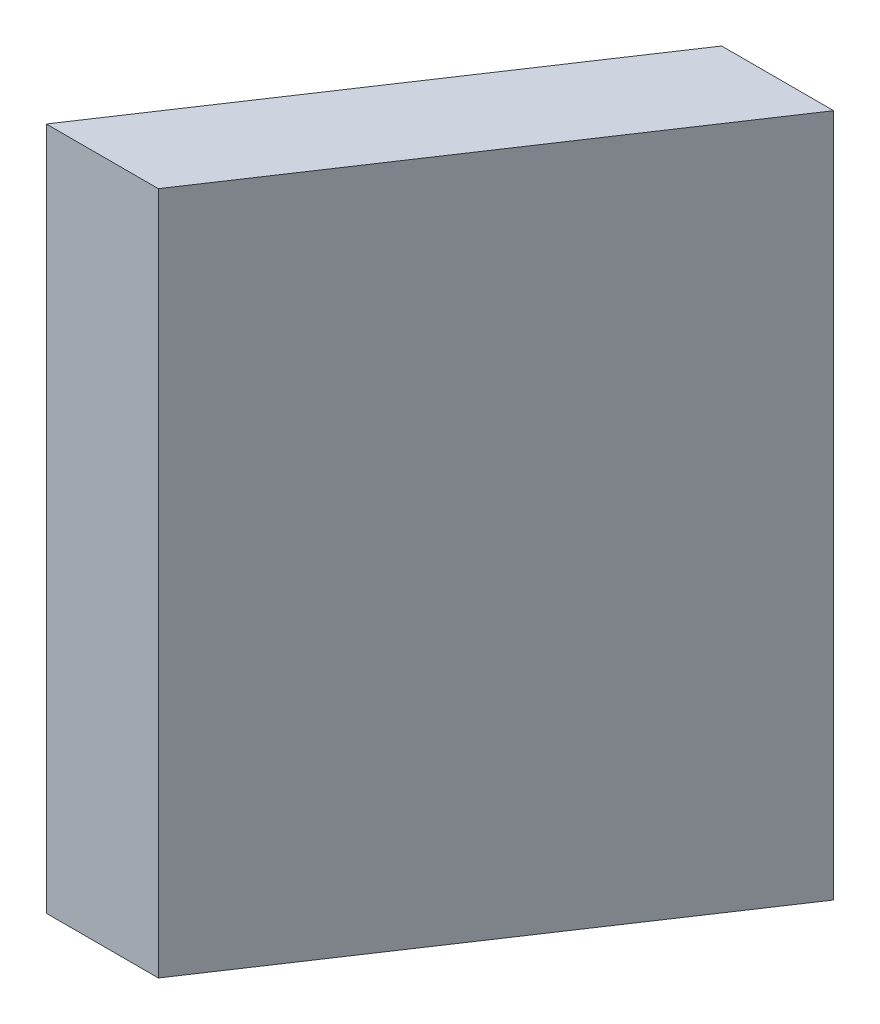
ISO-10303-21;
HEADER;
FILE_DESCRIPTION(('STEP AP214'),'2;1');
FILE_NAME('part.step','',(''),(''),'','','');
FILE_SCHEMA(('AUTOMOTIVE_DESIGN { 1 0 10303 214 1 1 1 1 }'));
ENDSEC;
DATA;
#1=APPLICATION_CONTEXT('core data for automotive mechanical design processes');
#2=APPLICATION_PROTOCOL_DEFINITION('international standard','automotive_design',2000,#1);
#3=PRODUCT_CONTEXT('',#1,'mechanical');
#4=PRODUCT('Part','Part','',(#3));
#5=PRODUCT_RELATED_PRODUCT_CATEGORY('part','',(#4));
#6=PRODUCT_DEFINITION_FORMATION('','',#4);
#7=PRODUCT_DEFINITION_CONTEXT('part definition',#1,'design');
#8=PRODUCT_DEFINITION('design','',#6,#7);
#9=PRODUCT_DEFINITION_SHAPE('','',#8);
#10=(LENGTH_UNIT() NAMED_UNIT(*) SI_UNIT(.MILLI.,.METRE.));
#11=(NAMED_UNIT(*) PLANE_ANGLE_UNIT() SI_UNIT($,.RADIAN.));
#12=(NAMED_UNIT(*) SI_UNIT($,.STERADIAN.) SOLID_ANGLE_UNIT());
#13=UNCERTAINTY_MEASURE_WITH_UNIT(LENGTH_MEASURE(1.E-05),#10,'distance_accuracy_value','');
#14=(GEOMETRIC_REPRESENTATION_CONTEXT(3) GLOBAL_UNCERTAINTY_ASSIGNED_CONTEXT((#13)) GLOBAL_UNIT_ASSIGNED_CONTEXT((#10,
#11,#12)) REPRESENTATION_CONTEXT('',''));
#15=CARTESIAN_POINT('',(0.,0.,0.));
#16=DIRECTION('',(0.,0.,1.));
#17=DIRECTION('',(1.,0.,0.));
#18=AXIS2_PLACEMENT_3D('',#15,#16,#17);
#19=CARTESIAN_POINT('',(39.04895885002,69.85,-41.402));
#20=DIRECTION('',(0.,0.,1.));
#21=DIRECTION('',(1.,0.,0.));
#22=AXIS2_PLACEMENT_3D('',#19,#20,#21);
#23=PLANE('',#22);
#24=DIRECTION('',(-1.,0.,0.));
#25=VECTOR('',#24,1.);
#26=CARTESIAN_POINT('',(39.04895885002,0.,-41.402));
#27=LINE('',#26,#25);
#28=CARTESIAN_POINT('',(39.04895885002,0.,-41.402));
#29=VERTEX_POINT('',#28);
#30=CARTESIAN_POINT('',(27.6013335258534,0.,-41.402));
#31=VERTEX_POINT('',#30);
#32=EDGE_CURVE('E99',#29,#31,#27,.T.);
#33=ORIENTED_EDGE('',*,*,#32,.T.);
#34=DIRECTION('',(0.,-1.,0.));
#35=VECTOR('',#34,1.);
#36=CARTESIAN_POINT('',(27.6013335258534,69.85,-41.402));
#37=LINE('',#36,#35);
#38=CARTESIAN_POINT('',(27.6013335258534,69.85,-41.402));
#39=VERTEX_POINT('',#38);
#40=EDGE_CURVE('E11',#39,#31,#37,.T.);
#41=ORIENTED_EDGE('',*,*,#40,.F.);
#42=DIRECTION('',(-1.,0.,0.));
#43=VECTOR('',#42,1.);
#44=CARTESIAN_POINT('',(39.04895885002,69.85,-41.402));
#45=LINE('',#44,#43);
#46=CARTESIAN_POINT('',(39.04895885002,69.85,-41.402));
#47=VERTEX_POINT('',#46);
#48=EDGE_CURVE('E87',#47,#39,#45,.T.);
#49=ORIENTED_EDGE('',*,*,#48,.F.);
#50=DIRECTION('',(0.,-1.,0.));
#51=VECTOR('',#50,1.);
#52=CARTESIAN_POINT('',(39.04895885002,69.85,-41.402));
#53=LINE('',#52,#51);
#54=EDGE_CURVE('E95',#47,#29,#53,.T.);
#55=ORIENTED_EDGE('',*,*,#54,.T.);
#56=EDGE_LOOP('',(#33,#41,#49,#55));
#57=FACE_BOUND('',#56,.T.);
#58=ADVANCED_FACE('F36',(#57),#23,.F.);
#59=CARTESIAN_POINT('',(27.6013335258534,69.85,-41.402));
#60=DIRECTION('',(0.832050292552129,0.,0.554700198903802));
#61=DIRECTION('',(0.554700198903802,0.,-0.832050292552129));
#62=AXIS2_PLACEMENT_3D('',#59,#60,#61);
#63=PLANE('',#62);
#64=DIRECTION('',(-0.554700198903801,0.,0.832050292552129));
#65=VECTOR('',#64,1.);
#66=CARTESIAN_POINT('',(27.6013335258534,0.,-41.402));
#67=LINE('',#66,#65);
#68=CARTESIAN_POINT('',(0.,0.,0.));
#69=VERTEX_POINT('',#68);
#70=EDGE_CURVE('E91',#31,#69,#67,.T.);
#71=ORIENTED_EDGE('',*,*,#70,.T.);
#72=DIRECTION('',(0.,-1.,0.));
#73=VECTOR('',#72,1.);
#74=CARTESIAN_POINT('',(0.,69.85,0.));
#75=LINE('',#74,#73);
#76=CARTESIAN_POINT('',(0.,69.85,0.));
#77=VERTEX_POINT('',#76);
#78=EDGE_CURVE('E44',#77,#69,#75,.T.);
#79=ORIENTED_EDGE('',*,*,#78,.F.);
#80=DIRECTION('',(-0.554700198903801,0.,0.832050292552129));
#81=VECTOR('',#80,1.);
#82=CARTESIAN_POINT('',(27.6013335258534,69.85,-41.402));
#83=LINE('',#82,#81);
#84=EDGE_CURVE('E82',#39,#77,#83,.T.);
#85=ORIENTED_EDGE('',*,*,#84,.F.);
#86=ORIENTED_EDGE('',*,*,#40,.T.);
#87=EDGE_LOOP('',(#71,#79,#85,#86));
#88=FACE_BOUND('',#87,.T.);
#89=ADVANCED_FACE('F90',(#88),#63,.F.);
#90=CARTESIAN_POINT('',(11.4476253241666,69.85,0.));
#91=DIRECTION('',(0.,0.,-1.));
#92=DIRECTION('',(-1.,0.,0.));
#93=AXIS2_PLACEMENT_3D('',#90,#91,#92);
#94=PLANE('',#93);
#95=DIRECTION('',(1.,0.,0.));
#96=VECTOR('',#95,1.);
#97=CARTESIAN_POINT('',(11.4476253241666,0.,0.));
#98=LINE('',#97,#96);
#99=CARTESIAN_POINT('',(11.4476253241666,0.,0.));
#100=VERTEX_POINT('',#99);
#101=EDGE_CURVE('E69',#69,#100,#98,.T.);
#102=ORIENTED_EDGE('',*,*,#101,.T.);
#103=DIRECTION('',(0.,-1.,0.));
#104=VECTOR('',#103,1.);
#105=CARTESIAN_POINT('',(11.4476253241666,69.85,0.));
#106=LINE('',#105,#104);
#107=CARTESIAN_POINT('',(11.4476253241666,69.85,0.));
#108=VERTEX_POINT('',#107);
#109=EDGE_CURVE('E92',#108,#100,#106,.T.);
#110=ORIENTED_EDGE('',*,*,#109,.F.);
#111=DIRECTION('',(1.,0.,0.));
#112=VECTOR('',#111,1.);
#113=CARTESIAN_POINT('',(11.4476253241666,69.85,0.));
#114=LINE('',#113,#112);
#115=EDGE_CURVE('E85',#77,#108,#114,.T.);
#116=ORIENTED_EDGE('',*,*,#115,.F.);
#117=ORIENTED_EDGE('',*,*,#78,.T.);
#118=EDGE_LOOP('',(#102,#110,#116,#117));
#119=FACE_BOUND('',#118,.T.);
#120=ADVANCED_FACE('F93',(#119),#94,.F.);
#121=CARTESIAN_POINT('',(39.04895885002,69.85,-41.402));
#122=DIRECTION('',(-0.832050292552129,0.,-0.554700198903801));
#123=DIRECTION('',(-0.554700198903801,0.,0.832050292552129));
#124=AXIS2_PLACEMENT_3D('',#121,#122,#123);
#125=PLANE('',#124);
#126=DIRECTION('',(0.554700198903801,0.,-0.832050292552129));
#127=VECTOR('',#126,1.);
#128=CARTESIAN_POINT('',(39.04895885002,0.,-41.402));
#129=LINE('',#128,#127);
#130=EDGE_CURVE('E75',#100,#29,#129,.T.);
#131=ORIENTED_EDGE('',*,*,#130,.T.);
#132=ORIENTED_EDGE('',*,*,#54,.F.);
#133=DIRECTION('',(0.554700198903801,0.,-0.832050292552129));
#134=VECTOR('',#133,1.);
#135=CARTESIAN_POINT('',(39.04895885002,69.85,-41.402));
#136=LINE('',#135,#134);
#137=EDGE_CURVE('E52',#108,#47,#136,.T.);
#138=ORIENTED_EDGE('',*,*,#137,.F.);
#139=ORIENTED_EDGE('',*,*,#109,.T.);
#140=EDGE_LOOP('',(#131,#132,#138,#139));
#141=FACE_BOUND('',#140,.T.);
#142=ADVANCED_FACE('F106',(#141),#125,.F.);
#143=CARTESIAN_POINT('',(0.,69.85,0.));
#144=DIRECTION('',(0.,1.,0.));
#145=DIRECTION('',(0.,0.,1.));
#146=AXIS2_PLACEMENT_3D('',#143,#144,#145);
#147=PLANE('',#146);
#148=ORIENTED_EDGE('',*,*,#48,.T.);
#149=ORIENTED_EDGE('',*,*,#84,.T.);
#150=ORIENTED_EDGE('',*,*,#115,.T.);
#151=ORIENTED_EDGE('',*,*,#137,.T.);
#152=EDGE_LOOP('',(#148,#149,#150,#151));
#153=FACE_BOUND('',#152,.T.);
#154=ADVANCED_FACE('F83',(#153),#147,.T.);
#155=CARTESIAN_POINT('',(0.,0.,0.));
#156=DIRECTION('',(0.,1.,0.));
#157=DIRECTION('',(0.,0.,1.));
#158=AXIS2_PLACEMENT_3D('',#155,#156,#157);
#159=PLANE('',#158);
#160=ORIENTED_EDGE('',*,*,#32,.F.);
#161=ORIENTED_EDGE('',*,*,#130,.F.);
#162=ORIENTED_EDGE('',*,*,#101,.F.);
#163=ORIENTED_EDGE('',*,*,#70,.F.);
#164=EDGE_LOOP('',(#160,#161,#162,#163));
#165=FACE_BOUND('',#164,.T.);
#166=ADVANCED_FACE('F109',(#165),#159,.F.);
#167=CLOSED_SHELL('',(#58,#89,#120,#142,#154,#166));
#168=MANIFOLD_SOLID_BREP('B2',#167);
#169=ADVANCED_BREP_SHAPE_REPRESENTATION('',(#18,#168),#14);
#170=SHAPE_DEFINITION_REPRESENTATION(#9,#169);
ENDSEC;
END-ISO-10303-21;
